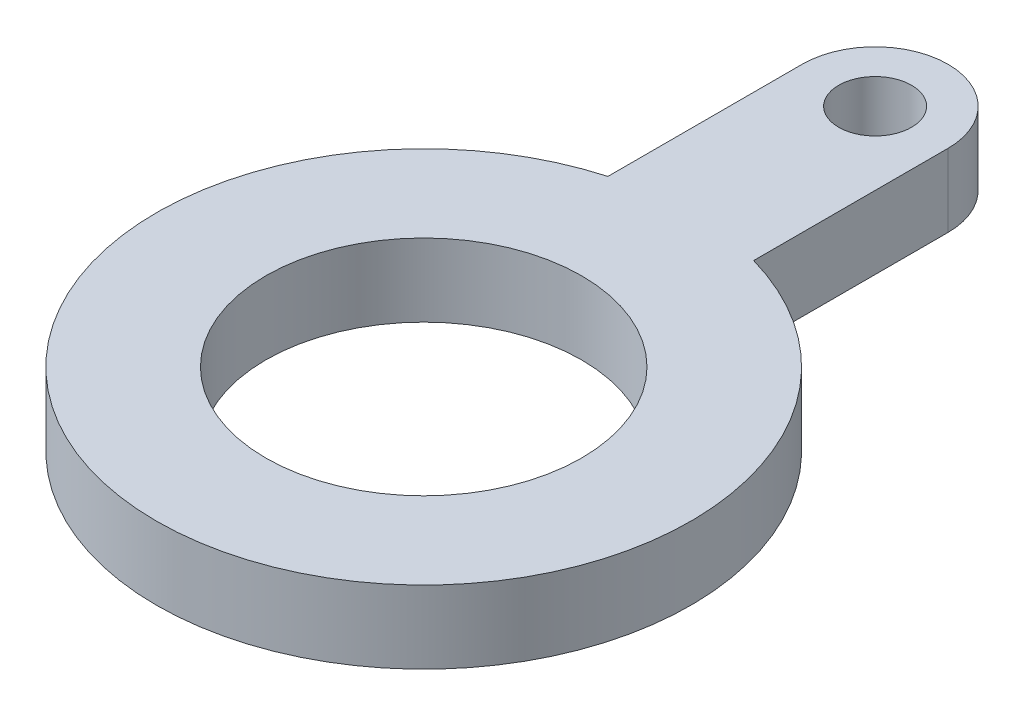
ISO-10303-21;
HEADER;
FILE_DESCRIPTION(('STEP AP214'),'2;1');
FILE_NAME('part.step','',(''),(''),'','','');
FILE_SCHEMA(('AUTOMOTIVE_DESIGN { 1 0 10303 214 1 1 1 1 }'));
ENDSEC;
DATA;
#1=APPLICATION_CONTEXT('core data for automotive mechanical design processes');
#2=APPLICATION_PROTOCOL_DEFINITION('international standard','automotive_design',2000,#1);
#3=PRODUCT_CONTEXT('',#1,'mechanical');
#4=PRODUCT('Part','Part','',(#3));
#5=PRODUCT_RELATED_PRODUCT_CATEGORY('part','',(#4));
#6=PRODUCT_DEFINITION_FORMATION('','',#4);
#7=PRODUCT_DEFINITION_CONTEXT('part definition',#1,'design');
#8=PRODUCT_DEFINITION('design','',#6,#7);
#9=PRODUCT_DEFINITION_SHAPE('','',#8);
#10=(LENGTH_UNIT() NAMED_UNIT(*) SI_UNIT(.MILLI.,.METRE.));
#11=(NAMED_UNIT(*) PLANE_ANGLE_UNIT() SI_UNIT($,.RADIAN.));
#12=(NAMED_UNIT(*) SI_UNIT($,.STERADIAN.) SOLID_ANGLE_UNIT());
#13=UNCERTAINTY_MEASURE_WITH_UNIT(LENGTH_MEASURE(1.E-05),#10,'distance_accuracy_value','');
#14=(GEOMETRIC_REPRESENTATION_CONTEXT(3) GLOBAL_UNCERTAINTY_ASSIGNED_CONTEXT((#13)) GLOBAL_UNIT_ASSIGNED_CONTEXT((#10,
#11,#12)) REPRESENTATION_CONTEXT('',''));
#15=CARTESIAN_POINT('',(0.,0.,0.));
#16=DIRECTION('',(0.,0.,1.));
#17=DIRECTION('',(1.,0.,0.));
#18=AXIS2_PLACEMENT_3D('',#15,#16,#17);
#19=CARTESIAN_POINT('',(0.,3.,0.));
#20=DIRECTION('',(0.,1.,0.));
#21=DIRECTION('',(0.,0.,1.));
#22=AXIS2_PLACEMENT_3D('',#19,#20,#21);
#23=PLANE('',#22);
#24=CARTESIAN_POINT('',(0.,3.,0.));
#25=DIRECTION('',(0.,1.,0.));
#26=DIRECTION('',(0.,0.,1.));
#27=AXIS2_PLACEMENT_3D('',#24,#25,#26);
#28=CIRCLE('',#27,6.5);
#29=CARTESIAN_POINT('',(0.,3.,6.5));
#30=VERTEX_POINT('',#29);
#31=EDGE_CURVE('E129',#30,#30,#28,.T.);
#32=ORIENTED_EDGE('',*,*,#31,.F.);
#33=EDGE_LOOP('',(#32));
#34=FACE_BOUND('',#33,.T.);
#35=CARTESIAN_POINT('',(0.,3.,0.));
#36=DIRECTION('',(0.,1.,0.));
#37=DIRECTION('',(0.,0.,1.));
#38=AXIS2_PLACEMENT_3D('',#35,#36,#37);
#39=CIRCLE('',#38,11.);
#40=CARTESIAN_POINT('',(-3.,3.,-10.5830052442584));
#41=VERTEX_POINT('',#40);
#42=CARTESIAN_POINT('',(3.,3.,-10.5830052442584));
#43=VERTEX_POINT('',#42);
#44=EDGE_CURVE('E113',#41,#43,#39,.T.);
#45=ORIENTED_EDGE('',*,*,#44,.T.);
#46=DIRECTION('',(0.,0.,-1.));
#47=VECTOR('',#46,1.);
#48=CARTESIAN_POINT('',(3.,3.,-10.5830052442584));
#49=LINE('',#48,#47);
#50=CARTESIAN_POINT('',(3.,3.,-18.5830052442584));
#51=VERTEX_POINT('',#50);
#52=EDGE_CURVE('E106',#43,#51,#49,.T.);
#53=ORIENTED_EDGE('',*,*,#52,.T.);
#54=CARTESIAN_POINT('',(0.,3.,-18.5830052442584));
#55=DIRECTION('',(0.,1.,0.));
#56=DIRECTION('',(0.,0.,1.));
#57=AXIS2_PLACEMENT_3D('',#54,#55,#56);
#58=CIRCLE('',#57,3.);
#59=CARTESIAN_POINT('',(-3.,3.,-18.5830052442584));
#60=VERTEX_POINT('',#59);
#61=EDGE_CURVE('E112',#51,#60,#58,.T.);
#62=ORIENTED_EDGE('',*,*,#61,.T.);
#63=DIRECTION('',(0.,0.,-1.));
#64=VECTOR('',#63,1.);
#65=CARTESIAN_POINT('',(-3.,3.,-10.5830052442584));
#66=LINE('',#65,#64);
#67=EDGE_CURVE('E122',#41,#60,#66,.T.);
#68=ORIENTED_EDGE('',*,*,#67,.F.);
#69=EDGE_LOOP('',(#45,#53,#62,#68));
#70=FACE_BOUND('',#69,.T.);
#71=CARTESIAN_POINT('',(0.,3.,-18.5830052442584));
#72=DIRECTION('',(0.,1.,0.));
#73=DIRECTION('',(0.,0.,1.));
#74=AXIS2_PLACEMENT_3D('',#71,#72,#73);
#75=CIRCLE('',#74,1.5);
#76=CARTESIAN_POINT('',(0.,3.,-17.0830052442584));
#77=VERTEX_POINT('',#76);
#78=EDGE_CURVE('E142',#77,#77,#75,.T.);
#79=ORIENTED_EDGE('',*,*,#78,.F.);
#80=EDGE_LOOP('',(#79));
#81=FACE_BOUND('',#80,.T.);
#82=ADVANCED_FACE('F63',(#34,#70,#81),#23,.T.);
#83=CARTESIAN_POINT('',(0.,0.,0.));
#84=DIRECTION('',(0.,1.,0.));
#85=DIRECTION('',(0.,0.,1.));
#86=AXIS2_PLACEMENT_3D('',#83,#84,#85);
#87=PLANE('',#86);
#88=CARTESIAN_POINT('',(0.,0.,0.));
#89=DIRECTION('',(0.,1.,0.));
#90=DIRECTION('',(0.,0.,1.));
#91=AXIS2_PLACEMENT_3D('',#88,#89,#90);
#92=CIRCLE('',#91,11.);
#93=CARTESIAN_POINT('',(-3.,0.,-10.5830052442584));
#94=VERTEX_POINT('',#93);
#95=CARTESIAN_POINT('',(3.,0.,-10.5830052442584));
#96=VERTEX_POINT('',#95);
#97=EDGE_CURVE('E127',#94,#96,#92,.T.);
#98=ORIENTED_EDGE('',*,*,#97,.F.);
#99=DIRECTION('',(0.,0.,-1.));
#100=VECTOR('',#99,1.);
#101=CARTESIAN_POINT('',(-3.,0.,-10.5830052442584));
#102=LINE('',#101,#100);
#103=CARTESIAN_POINT('',(-3.,0.,-18.5830052442584));
#104=VERTEX_POINT('',#103);
#105=EDGE_CURVE('E133',#94,#104,#102,.T.);
#106=ORIENTED_EDGE('',*,*,#105,.T.);
#107=CARTESIAN_POINT('',(0.,0.,-18.5830052442584));
#108=DIRECTION('',(0.,1.,0.));
#109=DIRECTION('',(0.,0.,1.));
#110=AXIS2_PLACEMENT_3D('',#107,#108,#109);
#111=CIRCLE('',#110,3.);
#112=CARTESIAN_POINT('',(3.,0.,-18.5830052442584));
#113=VERTEX_POINT('',#112);
#114=EDGE_CURVE('E131',#113,#104,#111,.T.);
#115=ORIENTED_EDGE('',*,*,#114,.F.);
#116=DIRECTION('',(0.,0.,-1.));
#117=VECTOR('',#116,1.);
#118=CARTESIAN_POINT('',(3.,0.,-10.5830052442584));
#119=LINE('',#118,#117);
#120=EDGE_CURVE('E118',#96,#113,#119,.T.);
#121=ORIENTED_EDGE('',*,*,#120,.F.);
#122=EDGE_LOOP('',(#98,#106,#115,#121));
#123=FACE_BOUND('',#122,.T.);
#124=CARTESIAN_POINT('',(0.,0.,0.));
#125=DIRECTION('',(0.,1.,0.));
#126=DIRECTION('',(0.,0.,1.));
#127=AXIS2_PLACEMENT_3D('',#124,#125,#126);
#128=CIRCLE('',#127,6.5);
#129=CARTESIAN_POINT('',(0.,0.,6.5));
#130=VERTEX_POINT('',#129);
#131=EDGE_CURVE('E139',#130,#130,#128,.T.);
#132=ORIENTED_EDGE('',*,*,#131,.T.);
#133=EDGE_LOOP('',(#132));
#134=FACE_BOUND('',#133,.T.);
#135=CARTESIAN_POINT('',(0.,0.,-18.5830052442584));
#136=DIRECTION('',(0.,1.,0.));
#137=DIRECTION('',(0.,0.,1.));
#138=AXIS2_PLACEMENT_3D('',#135,#136,#137);
#139=CIRCLE('',#138,1.5);
#140=CARTESIAN_POINT('',(0.,0.,-17.0830052442584));
#141=VERTEX_POINT('',#140);
#142=EDGE_CURVE('E145',#141,#141,#139,.T.);
#143=ORIENTED_EDGE('',*,*,#142,.T.);
#144=EDGE_LOOP('',(#143));
#145=FACE_BOUND('',#144,.T.);
#146=ADVANCED_FACE('F154',(#123,#134,#145),#87,.F.);
#147=CARTESIAN_POINT('',(0.,3.,0.));
#148=DIRECTION('',(0.,-1.,0.));
#149=DIRECTION('',(0.,0.,-1.));
#150=AXIS2_PLACEMENT_3D('',#147,#148,#149);
#151=CYLINDRICAL_SURFACE('',#150,11.);
#152=ORIENTED_EDGE('',*,*,#97,.T.);
#153=DIRECTION('',(0.,-1.,0.));
#154=VECTOR('',#153,1.);
#155=CARTESIAN_POINT('',(3.,3.,-10.5830052442584));
#156=LINE('',#155,#154);
#157=EDGE_CURVE('E12',#43,#96,#156,.T.);
#158=ORIENTED_EDGE('',*,*,#157,.F.);
#159=ORIENTED_EDGE('',*,*,#44,.F.);
#160=DIRECTION('',(0.,-1.,0.));
#161=VECTOR('',#160,1.);
#162=CARTESIAN_POINT('',(-3.,3.,-10.5830052442584));
#163=LINE('',#162,#161);
#164=EDGE_CURVE('E80',#41,#94,#163,.T.);
#165=ORIENTED_EDGE('',*,*,#164,.T.);
#166=EDGE_LOOP('',(#152,#158,#159,#165));
#167=FACE_BOUND('',#166,.T.);
#168=ADVANCED_FACE('F65',(#167),#151,.T.);
#169=CARTESIAN_POINT('',(3.,3.,-10.5830052442584));
#170=DIRECTION('',(-1.,0.,0.));
#171=DIRECTION('',(0.,0.,1.));
#172=AXIS2_PLACEMENT_3D('',#169,#170,#171);
#173=PLANE('',#172);
#174=ORIENTED_EDGE('',*,*,#120,.T.);
#175=DIRECTION('',(0.,-1.,0.));
#176=VECTOR('',#175,1.);
#177=CARTESIAN_POINT('',(3.,3.,-18.5830052442584));
#178=LINE('',#177,#176);
#179=EDGE_CURVE('E72',#51,#113,#178,.T.);
#180=ORIENTED_EDGE('',*,*,#179,.F.);
#181=ORIENTED_EDGE('',*,*,#52,.F.);
#182=ORIENTED_EDGE('',*,*,#157,.T.);
#183=EDGE_LOOP('',(#174,#180,#181,#182));
#184=FACE_BOUND('',#183,.T.);
#185=ADVANCED_FACE('F117',(#184),#173,.F.);
#186=CARTESIAN_POINT('',(0.,3.,-18.5830052442584));
#187=DIRECTION('',(0.,-1.,0.));
#188=DIRECTION('',(0.,0.,-1.));
#189=AXIS2_PLACEMENT_3D('',#186,#187,#188);
#190=CYLINDRICAL_SURFACE('',#189,3.);
#191=ORIENTED_EDGE('',*,*,#114,.T.);
#192=DIRECTION('',(0.,-1.,0.));
#193=VECTOR('',#192,1.);
#194=CARTESIAN_POINT('',(-3.,3.,-18.5830052442584));
#195=LINE('',#194,#193);
#196=EDGE_CURVE('E95',#60,#104,#195,.T.);
#197=ORIENTED_EDGE('',*,*,#196,.F.);
#198=ORIENTED_EDGE('',*,*,#61,.F.);
#199=ORIENTED_EDGE('',*,*,#179,.T.);
#200=EDGE_LOOP('',(#191,#197,#198,#199));
#201=FACE_BOUND('',#200,.T.);
#202=ADVANCED_FACE('F121',(#201),#190,.T.);
#203=CARTESIAN_POINT('',(-3.,3.,-10.5830052442584));
#204=DIRECTION('',(-1.,0.,0.));
#205=DIRECTION('',(0.,0.,1.));
#206=AXIS2_PLACEMENT_3D('',#203,#204,#205);
#207=PLANE('',#206);
#208=ORIENTED_EDGE('',*,*,#105,.F.);
#209=ORIENTED_EDGE('',*,*,#164,.F.);
#210=ORIENTED_EDGE('',*,*,#67,.T.);
#211=ORIENTED_EDGE('',*,*,#196,.T.);
#212=EDGE_LOOP('',(#208,#209,#210,#211));
#213=FACE_BOUND('',#212,.T.);
#214=ADVANCED_FACE('F166',(#213),#207,.T.);
#215=CARTESIAN_POINT('',(0.,3.,0.));
#216=DIRECTION('',(0.,-1.,0.));
#217=DIRECTION('',(0.,0.,-1.));
#218=AXIS2_PLACEMENT_3D('',#215,#216,#217);
#219=CYLINDRICAL_SURFACE('',#218,6.5);
#220=ORIENTED_EDGE('',*,*,#31,.T.);
#221=EDGE_LOOP('',(#220));
#222=FACE_BOUND('',#221,.T.);
#223=ORIENTED_EDGE('',*,*,#131,.F.);
#224=EDGE_LOOP('',(#223));
#225=FACE_BOUND('',#224,.T.);
#226=ADVANCED_FACE('F163',(#222,#225),#219,.F.);
#227=CARTESIAN_POINT('',(0.,3.,-18.5830052442584));
#228=DIRECTION('',(0.,-1.,0.));
#229=DIRECTION('',(0.,0.,-1.));
#230=AXIS2_PLACEMENT_3D('',#227,#228,#229);
#231=CYLINDRICAL_SURFACE('',#230,1.5);
#232=ORIENTED_EDGE('',*,*,#78,.T.);
#233=EDGE_LOOP('',(#232));
#234=FACE_BOUND('',#233,.T.);
#235=ORIENTED_EDGE('',*,*,#142,.F.);
#236=EDGE_LOOP('',(#235));
#237=FACE_BOUND('',#236,.T.);
#238=ADVANCED_FACE('F151',(#234,#237),#231,.F.);
#239=CLOSED_SHELL('',(#82,#146,#168,#185,#202,#214,#226,#238));
#240=MANIFOLD_SOLID_BREP('B2',#239);
#241=ADVANCED_BREP_SHAPE_REPRESENTATION('',(#18,#240),#14);
#242=SHAPE_DEFINITION_REPRESENTATION(#9,#241);
ENDSEC;
END-ISO-10303-21;
